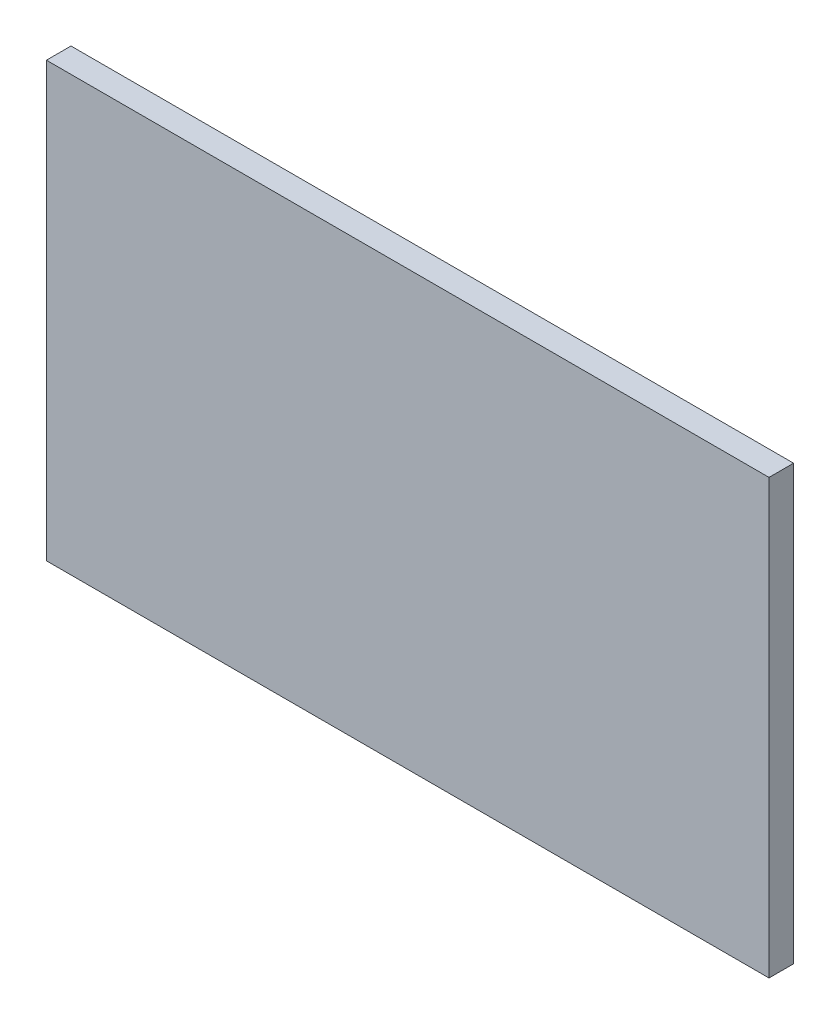
ISO-10303-21;
HEADER;
FILE_DESCRIPTION(('STEP AP214'),'2;1');
FILE_NAME('part.step','',(''),(''),'','','');
FILE_SCHEMA(('AUTOMOTIVE_DESIGN { 1 0 10303 214 1 1 1 1 }'));
ENDSEC;
DATA;
#1=APPLICATION_CONTEXT('core data for automotive mechanical design processes');
#2=APPLICATION_PROTOCOL_DEFINITION('international standard','automotive_design',2000,#1);
#3=PRODUCT_CONTEXT('',#1,'mechanical');
#4=PRODUCT('Part','Part','',(#3));
#5=PRODUCT_RELATED_PRODUCT_CATEGORY('part','',(#4));
#6=PRODUCT_DEFINITION_FORMATION('','',#4);
#7=PRODUCT_DEFINITION_CONTEXT('part definition',#1,'design');
#8=PRODUCT_DEFINITION('design','',#6,#7);
#9=PRODUCT_DEFINITION_SHAPE('','',#8);
#10=(LENGTH_UNIT() NAMED_UNIT(*) SI_UNIT(.MILLI.,.METRE.));
#11=(NAMED_UNIT(*) PLANE_ANGLE_UNIT() SI_UNIT($,.RADIAN.));
#12=(NAMED_UNIT(*) SI_UNIT($,.STERADIAN.) SOLID_ANGLE_UNIT());
#13=UNCERTAINTY_MEASURE_WITH_UNIT(LENGTH_MEASURE(1.E-05),#10,'distance_accuracy_value','');
#14=(GEOMETRIC_REPRESENTATION_CONTEXT(3) GLOBAL_UNCERTAINTY_ASSIGNED_CONTEXT((#13)) GLOBAL_UNIT_ASSIGNED_CONTEXT((#10,
#11,#12)) REPRESENTATION_CONTEXT('',''));
#15=CARTESIAN_POINT('',(0.,0.,0.));
#16=DIRECTION('',(0.,0.,1.));
#17=DIRECTION('',(1.,0.,0.));
#18=AXIS2_PLACEMENT_3D('',#15,#16,#17);
#19=CARTESIAN_POINT('',(-500.,-300.,34.));
#20=DIRECTION('',(1.,0.,0.));
#21=DIRECTION('',(0.,0.,-1.));
#22=AXIS2_PLACEMENT_3D('',#19,#20,#21);
#23=PLANE('',#22);
#24=DIRECTION('',(0.,-1.,0.));
#25=VECTOR('',#24,1.);
#26=CARTESIAN_POINT('',(-500.,-300.,0.));
#27=LINE('',#26,#25);
#28=CARTESIAN_POINT('',(-500.,300.,0.));
#29=VERTEX_POINT('',#28);
#30=CARTESIAN_POINT('',(-500.,-300.,0.));
#31=VERTEX_POINT('',#30);
#32=EDGE_CURVE('E98',#29,#31,#27,.T.);
#33=ORIENTED_EDGE('',*,*,#32,.T.);
#34=DIRECTION('',(0.,0.,-1.));
#35=VECTOR('',#34,1.);
#36=CARTESIAN_POINT('',(-500.,-300.,34.));
#37=LINE('',#36,#35);
#38=CARTESIAN_POINT('',(-500.,-300.,34.));
#39=VERTEX_POINT('',#38);
#40=EDGE_CURVE('E11',#39,#31,#37,.T.);
#41=ORIENTED_EDGE('',*,*,#40,.F.);
#42=DIRECTION('',(0.,-1.,0.));
#43=VECTOR('',#42,1.);
#44=CARTESIAN_POINT('',(-500.,-300.,34.));
#45=LINE('',#44,#43);
#46=CARTESIAN_POINT('',(-500.,300.,34.));
#47=VERTEX_POINT('',#46);
#48=EDGE_CURVE('E86',#47,#39,#45,.T.);
#49=ORIENTED_EDGE('',*,*,#48,.F.);
#50=DIRECTION('',(0.,0.,-1.));
#51=VECTOR('',#50,1.);
#52=CARTESIAN_POINT('',(-500.,300.,34.));
#53=LINE('',#52,#51);
#54=EDGE_CURVE('E94',#47,#29,#53,.T.);
#55=ORIENTED_EDGE('',*,*,#54,.T.);
#56=EDGE_LOOP('',(#33,#41,#49,#55));
#57=FACE_BOUND('',#56,.T.);
#58=ADVANCED_FACE('F35',(#57),#23,.F.);
#59=CARTESIAN_POINT('',(500.,-300.,34.));
#60=DIRECTION('',(0.,1.,0.));
#61=DIRECTION('',(-1.,0.,0.));
#62=AXIS2_PLACEMENT_3D('',#59,#60,#61);
#63=PLANE('',#62);
#64=DIRECTION('',(1.,0.,0.));
#65=VECTOR('',#64,1.);
#66=CARTESIAN_POINT('',(500.,-300.,0.));
#67=LINE('',#66,#65);
#68=CARTESIAN_POINT('',(500.,-300.,0.));
#69=VERTEX_POINT('',#68);
#70=EDGE_CURVE('E90',#31,#69,#67,.T.);
#71=ORIENTED_EDGE('',*,*,#70,.T.);
#72=DIRECTION('',(0.,0.,-1.));
#73=VECTOR('',#72,1.);
#74=CARTESIAN_POINT('',(500.,-300.,34.));
#75=LINE('',#74,#73);
#76=CARTESIAN_POINT('',(500.,-300.,34.));
#77=VERTEX_POINT('',#76);
#78=EDGE_CURVE('E43',#77,#69,#75,.T.);
#79=ORIENTED_EDGE('',*,*,#78,.F.);
#80=DIRECTION('',(1.,0.,0.));
#81=VECTOR('',#80,1.);
#82=CARTESIAN_POINT('',(500.,-300.,34.));
#83=LINE('',#82,#81);
#84=EDGE_CURVE('E81',#39,#77,#83,.T.);
#85=ORIENTED_EDGE('',*,*,#84,.F.);
#86=ORIENTED_EDGE('',*,*,#40,.T.);
#87=EDGE_LOOP('',(#71,#79,#85,#86));
#88=FACE_BOUND('',#87,.T.);
#89=ADVANCED_FACE('F89',(#88),#63,.F.);
#90=CARTESIAN_POINT('',(500.,-300.,34.));
#91=DIRECTION('',(-1.,0.,0.));
#92=DIRECTION('',(0.,-1.,0.));
#93=AXIS2_PLACEMENT_3D('',#90,#91,#92);
#94=PLANE('',#93);
#95=DIRECTION('',(0.,1.,0.));
#96=VECTOR('',#95,1.);
#97=CARTESIAN_POINT('',(500.,-300.,0.));
#98=LINE('',#97,#96);
#99=CARTESIAN_POINT('',(500.,300.,0.));
#100=VERTEX_POINT('',#99);
#101=EDGE_CURVE('E68',#69,#100,#98,.T.);
#102=ORIENTED_EDGE('',*,*,#101,.T.);
#103=DIRECTION('',(0.,0.,-1.));
#104=VECTOR('',#103,1.);
#105=CARTESIAN_POINT('',(500.,300.,34.));
#106=LINE('',#105,#104);
#107=CARTESIAN_POINT('',(500.,300.,34.));
#108=VERTEX_POINT('',#107);
#109=EDGE_CURVE('E91',#108,#100,#106,.T.);
#110=ORIENTED_EDGE('',*,*,#109,.F.);
#111=DIRECTION('',(0.,1.,0.));
#112=VECTOR('',#111,1.);
#113=CARTESIAN_POINT('',(500.,-300.,34.));
#114=LINE('',#113,#112);
#115=EDGE_CURVE('E84',#77,#108,#114,.T.);
#116=ORIENTED_EDGE('',*,*,#115,.F.);
#117=ORIENTED_EDGE('',*,*,#78,.T.);
#118=EDGE_LOOP('',(#102,#110,#116,#117));
#119=FACE_BOUND('',#118,.T.);
#120=ADVANCED_FACE('F92',(#119),#94,.F.);
#121=CARTESIAN_POINT('',(500.,300.,34.));
#122=DIRECTION('',(0.,-1.,0.));
#123=DIRECTION('',(1.,0.,0.));
#124=AXIS2_PLACEMENT_3D('',#121,#122,#123);
#125=PLANE('',#124);
#126=DIRECTION('',(-1.,0.,0.));
#127=VECTOR('',#126,1.);
#128=CARTESIAN_POINT('',(500.,300.,0.));
#129=LINE('',#128,#127);
#130=EDGE_CURVE('E74',#100,#29,#129,.T.);
#131=ORIENTED_EDGE('',*,*,#130,.T.);
#132=ORIENTED_EDGE('',*,*,#54,.F.);
#133=DIRECTION('',(-1.,0.,0.));
#134=VECTOR('',#133,1.);
#135=CARTESIAN_POINT('',(500.,300.,34.));
#136=LINE('',#135,#134);
#137=EDGE_CURVE('E51',#108,#47,#136,.T.);
#138=ORIENTED_EDGE('',*,*,#137,.F.);
#139=ORIENTED_EDGE('',*,*,#109,.T.);
#140=EDGE_LOOP('',(#131,#132,#138,#139));
#141=FACE_BOUND('',#140,.T.);
#142=ADVANCED_FACE('F105',(#141),#125,.F.);
#143=CARTESIAN_POINT('',(0.,0.,34.));
#144=DIRECTION('',(0.,0.,1.));
#145=DIRECTION('',(1.,0.,0.));
#146=AXIS2_PLACEMENT_3D('',#143,#144,#145);
#147=PLANE('',#146);
#148=ORIENTED_EDGE('',*,*,#48,.T.);
#149=ORIENTED_EDGE('',*,*,#84,.T.);
#150=ORIENTED_EDGE('',*,*,#115,.T.);
#151=ORIENTED_EDGE('',*,*,#137,.T.);
#152=EDGE_LOOP('',(#148,#149,#150,#151));
#153=FACE_BOUND('',#152,.T.);
#154=ADVANCED_FACE('F82',(#153),#147,.T.);
#155=CARTESIAN_POINT('',(0.,0.,0.));
#156=DIRECTION('',(0.,0.,1.));
#157=DIRECTION('',(1.,0.,0.));
#158=AXIS2_PLACEMENT_3D('',#155,#156,#157);
#159=PLANE('',#158);
#160=ORIENTED_EDGE('',*,*,#32,.F.);
#161=ORIENTED_EDGE('',*,*,#130,.F.);
#162=ORIENTED_EDGE('',*,*,#101,.F.);
#163=ORIENTED_EDGE('',*,*,#70,.F.);
#164=EDGE_LOOP('',(#160,#161,#162,#163));
#165=FACE_BOUND('',#164,.T.);
#166=ADVANCED_FACE('F108',(#165),#159,.F.);
#167=CLOSED_SHELL('',(#58,#89,#120,#142,#154,#166));
#168=MANIFOLD_SOLID_BREP('B2',#167);
#169=ADVANCED_BREP_SHAPE_REPRESENTATION('',(#18,#168),#14);
#170=SHAPE_DEFINITION_REPRESENTATION(#9,#169);
ENDSEC;
END-ISO-10303-21;
